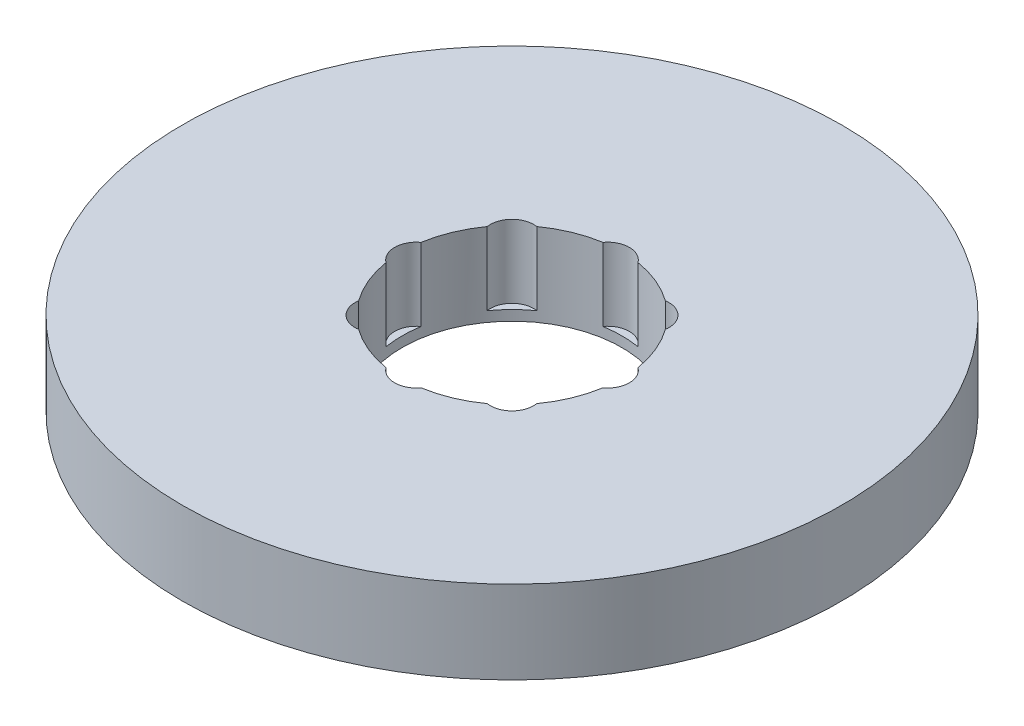
ISO-10303-21;
HEADER;
FILE_DESCRIPTION(('STEP AP214'),'2;1');
FILE_NAME('part.step','',(''),(''),'','','');
FILE_SCHEMA(('AUTOMOTIVE_DESIGN { 1 0 10303 214 1 1 1 1 }'));
ENDSEC;
DATA;
#1=APPLICATION_CONTEXT('core data for automotive mechanical design processes');
#2=APPLICATION_PROTOCOL_DEFINITION('international standard','automotive_design',2000,#1);
#3=PRODUCT_CONTEXT('',#1,'mechanical');
#4=PRODUCT('Part','Part','',(#3));
#5=PRODUCT_RELATED_PRODUCT_CATEGORY('part','',(#4));
#6=PRODUCT_DEFINITION_FORMATION('','',#4);
#7=PRODUCT_DEFINITION_CONTEXT('part definition',#1,'design');
#8=PRODUCT_DEFINITION('design','',#6,#7);
#9=PRODUCT_DEFINITION_SHAPE('','',#8);
#10=(LENGTH_UNIT() NAMED_UNIT(*) SI_UNIT(.MILLI.,.METRE.));
#11=(NAMED_UNIT(*) PLANE_ANGLE_UNIT() SI_UNIT($,.RADIAN.));
#12=(NAMED_UNIT(*) SI_UNIT($,.STERADIAN.) SOLID_ANGLE_UNIT());
#13=UNCERTAINTY_MEASURE_WITH_UNIT(LENGTH_MEASURE(1.E-05),#10,'distance_accuracy_value','');
#14=(GEOMETRIC_REPRESENTATION_CONTEXT(3) GLOBAL_UNCERTAINTY_ASSIGNED_CONTEXT((#13)) GLOBAL_UNIT_ASSIGNED_CONTEXT((#10,
#11,#12)) REPRESENTATION_CONTEXT('',''));
#15=CARTESIAN_POINT('',(0.,0.,0.));
#16=DIRECTION('',(0.,0.,1.));
#17=DIRECTION('',(1.,0.,0.));
#18=AXIS2_PLACEMENT_3D('',#15,#16,#17);
#19=CARTESIAN_POINT('',(0.,17.,0.));
#20=DIRECTION('',(0.,-1.,0.));
#21=DIRECTION('',(0.,0.,-1.));
#22=AXIS2_PLACEMENT_3D('',#19,#20,#21);
#23=CYLINDRICAL_SURFACE('',#22,67.5);
#24=CARTESIAN_POINT('',(0.,17.,0.));
#25=DIRECTION('',(0.,1.,0.));
#26=DIRECTION('',(0.,0.,1.));
#27=AXIS2_PLACEMENT_3D('',#24,#25,#26);
#28=CIRCLE('',#27,67.5);
#29=CARTESIAN_POINT('',(0.,17.,67.5));
#30=VERTEX_POINT('',#29);
#31=EDGE_CURVE('E183',#30,#30,#28,.T.);
#32=ORIENTED_EDGE('',*,*,#31,.F.);
#33=EDGE_LOOP('',(#32));
#34=FACE_BOUND('',#33,.T.);
#35=CARTESIAN_POINT('',(0.,0.,0.));
#36=DIRECTION('',(0.,1.,0.));
#37=DIRECTION('',(0.,0.,1.));
#38=AXIS2_PLACEMENT_3D('',#35,#36,#37);
#39=CIRCLE('',#38,67.5);
#40=CARTESIAN_POINT('',(0.,0.,67.5));
#41=VERTEX_POINT('',#40);
#42=EDGE_CURVE('E182',#41,#41,#39,.T.);
#43=ORIENTED_EDGE('',*,*,#42,.T.);
#44=EDGE_LOOP('',(#43));
#45=FACE_BOUND('',#44,.T.);
#46=ADVANCED_FACE('F39',(#34,#45),#23,.T.);
#47=CARTESIAN_POINT('',(0.,17.,0.));
#48=DIRECTION('',(0.,1.,0.));
#49=DIRECTION('',(0.,0.,1.));
#50=AXIS2_PLACEMENT_3D('',#47,#48,#49);
#51=PLANE('',#50);
#52=CARTESIAN_POINT('',(0.,17.,19.5928557793031));
#53=DIRECTION('',(0.,1.,0.));
#54=DIRECTION('',(1.,0.,0.));
#55=AXIS2_PLACEMENT_3D('',#52,#53,#54);
#56=CIRCLE('',#55,4.44290214076101);
#57=CARTESIAN_POINT('',(-3.58884169918766,17.,22.2119385749685));
#58=VERTEX_POINT('',#57);
#59=CARTESIAN_POINT('',(3.58884169918782,17.,22.2119385749684));
#60=VERTEX_POINT('',#59);
#61=EDGE_CURVE('E256',#58,#60,#56,.T.);
#62=ORIENTED_EDGE('',*,*,#61,.F.);
#63=CARTESIAN_POINT('',(0.,17.,0.));
#64=DIRECTION('',(0.,1.,0.));
#65=DIRECTION('',(0.,0.,1.));
#66=AXIS2_PLACEMENT_3D('',#63,#64,#65);
#67=CIRCLE('',#66,22.5);
#68=CARTESIAN_POINT('',(-13.1685180875585,17.,18.24390669176));
#69=VERTEX_POINT('',#68);
#70=EDGE_CURVE('E175',#69,#58,#67,.T.);
#71=ORIENTED_EDGE('',*,*,#70,.F.);
#72=CARTESIAN_POINT('',(-13.8542411843553,17.,13.8542411843553));
#73=DIRECTION('',(0.,1.,0.));
#74=DIRECTION('',(0.707106781186549,0.,0.707106781186546));
#75=AXIS2_PLACEMENT_3D('',#72,#73,#74);
#76=CIRCLE('',#75,4.44290214076101);
#77=CARTESIAN_POINT('',(-18.2439066917599,17.,13.1685180875586));
#78=VERTEX_POINT('',#77);
#79=EDGE_CURVE('E152',#78,#69,#76,.T.);
#80=ORIENTED_EDGE('',*,*,#79,.F.);
#81=CARTESIAN_POINT('',(-22.2119385749684,17.,3.58884169918774));
#82=VERTEX_POINT('',#81);
#83=EDGE_CURVE('E168',#82,#78,#67,.T.);
#84=ORIENTED_EDGE('',*,*,#83,.F.);
#85=CARTESIAN_POINT('',(-19.5928557793031,17.,0.));
#86=DIRECTION('',(0.,1.,0.));
#87=DIRECTION('',(0.,0.,1.));
#88=AXIS2_PLACEMENT_3D('',#85,#86,#87);
#89=CIRCLE('',#88,4.44290214076101);
#90=CARTESIAN_POINT('',(-22.2119385749684,17.,-3.58884169918774));
#91=VERTEX_POINT('',#90);
#92=EDGE_CURVE('E205',#91,#82,#89,.T.);
#93=ORIENTED_EDGE('',*,*,#92,.F.);
#94=CARTESIAN_POINT('',(-18.2439066917601,17.,-13.1685180875583));
#95=VERTEX_POINT('',#94);
#96=EDGE_CURVE('E181',#95,#91,#67,.T.);
#97=ORIENTED_EDGE('',*,*,#96,.F.);
#98=CARTESIAN_POINT('',(-13.8542411843555,17.,-13.8542411843551));
#99=DIRECTION('',(0.,1.,0.));
#100=DIRECTION('',(-0.707106781186539,0.,0.707106781186556));
#101=AXIS2_PLACEMENT_3D('',#98,#99,#100);
#102=CIRCLE('',#101,4.44290214076101);
#103=CARTESIAN_POINT('',(-13.1685180875588,17.,-18.2439066917598));
#104=VERTEX_POINT('',#103);
#105=EDGE_CURVE('E453',#104,#95,#102,.T.);
#106=ORIENTED_EDGE('',*,*,#105,.F.);
#107=CARTESIAN_POINT('',(-3.58884169918797,17.,-22.2119385749684));
#108=VERTEX_POINT('',#107);
#109=EDGE_CURVE('E189',#108,#104,#67,.T.);
#110=ORIENTED_EDGE('',*,*,#109,.F.);
#111=CARTESIAN_POINT('',(-2.05224270984245E-13,17.,-19.5928557793031));
#112=DIRECTION('',(0.,1.,0.));
#113=DIRECTION('',(-1.,0.,0.));
#114=AXIS2_PLACEMENT_3D('',#111,#112,#113);
#115=CIRCLE('',#114,4.44290214076101);
#116=CARTESIAN_POINT('',(3.5888416991875,17.,-22.2119385749685));
#117=VERTEX_POINT('',#116);
#118=EDGE_CURVE('E462',#117,#108,#115,.T.);
#119=ORIENTED_EDGE('',*,*,#118,.F.);
#120=CARTESIAN_POINT('',(13.1685180875584,17.,-18.2439066917601));
#121=VERTEX_POINT('',#120);
#122=EDGE_CURVE('E197',#121,#117,#67,.T.);
#123=ORIENTED_EDGE('',*,*,#122,.F.);
#124=CARTESIAN_POINT('',(13.8542411843552,17.,-13.8542411843554));
#125=DIRECTION('',(0.,1.,0.));
#126=DIRECTION('',(-0.707106781186554,0.,-0.707106781186541));
#127=AXIS2_PLACEMENT_3D('',#124,#125,#126);
#128=CIRCLE('',#127,4.44290214076101);
#129=CARTESIAN_POINT('',(18.2439066917598,17.,-13.1685180875587));
#130=VERTEX_POINT('',#129);
#131=EDGE_CURVE('E470',#130,#121,#128,.T.);
#132=ORIENTED_EDGE('',*,*,#131,.F.);
#133=CARTESIAN_POINT('',(22.2119385749684,17.,-3.58884169918774));
#134=VERTEX_POINT('',#133);
#135=EDGE_CURVE('E489',#134,#130,#67,.T.);
#136=ORIENTED_EDGE('',*,*,#135,.F.);
#137=CARTESIAN_POINT('',(19.5928557793031,17.,0.));
#138=DIRECTION('',(0.,1.,0.));
#139=DIRECTION('',(0.,0.,-1.));
#140=AXIS2_PLACEMENT_3D('',#137,#138,#139);
#141=CIRCLE('',#140,4.44290214076101);
#142=CARTESIAN_POINT('',(22.2119385749684,17.,3.58884169918774));
#143=VERTEX_POINT('',#142);
#144=EDGE_CURVE('E476',#143,#134,#141,.T.);
#145=ORIENTED_EDGE('',*,*,#144,.F.);
#146=CARTESIAN_POINT('',(18.24390669176,17.,13.1685180875585));
#147=VERTEX_POINT('',#146);
#148=EDGE_CURVE('E491',#147,#143,#67,.T.);
#149=ORIENTED_EDGE('',*,*,#148,.F.);
#150=CARTESIAN_POINT('',(13.8542411843554,17.,13.8542411843552));
#151=DIRECTION('',(0.,1.,0.));
#152=DIRECTION('',(0.707106781186544,0.,-0.707106781186551));
#153=AXIS2_PLACEMENT_3D('',#150,#151,#152);
#154=CIRCLE('',#153,4.44290214076101);
#155=CARTESIAN_POINT('',(13.1685180875586,17.,18.2439066917599));
#156=VERTEX_POINT('',#155);
#157=EDGE_CURVE('E475',#156,#147,#154,.T.);
#158=ORIENTED_EDGE('',*,*,#157,.F.);
#159=EDGE_CURVE('E190',#60,#156,#67,.T.);
#160=ORIENTED_EDGE('',*,*,#159,.F.);
#161=EDGE_LOOP('',(#62,#71,#80,#84,#93,#97,#106,#110,#119,#123,#132,#136,#145,#149,#158,#160));
#162=FACE_BOUND('',#161,.T.);
#163=ORIENTED_EDGE('',*,*,#31,.T.);
#164=EDGE_LOOP('',(#163));
#165=FACE_BOUND('',#164,.T.);
#166=ADVANCED_FACE('F170',(#162,#165),#51,.T.);
#167=CARTESIAN_POINT('',(0.,0.,0.));
#168=DIRECTION('',(0.,1.,0.));
#169=DIRECTION('',(0.,0.,1.));
#170=AXIS2_PLACEMENT_3D('',#167,#168,#169);
#171=PLANE('',#170);
#172=CARTESIAN_POINT('',(0.,0.,0.));
#173=DIRECTION('',(0.,1.,0.));
#174=DIRECTION('',(0.,0.,1.));
#175=AXIS2_PLACEMENT_3D('',#172,#173,#174);
#176=CIRCLE('',#175,22.5);
#177=CARTESIAN_POINT('',(0.,0.,22.5));
#178=VERTEX_POINT('',#177);
#179=EDGE_CURVE('E191',#178,#178,#176,.T.);
#180=ORIENTED_EDGE('',*,*,#179,.T.);
#181=EDGE_LOOP('',(#180));
#182=FACE_BOUND('',#181,.T.);
#183=ORIENTED_EDGE('',*,*,#42,.F.);
#184=EDGE_LOOP('',(#183));
#185=FACE_BOUND('',#184,.T.);
#186=ADVANCED_FACE('F277',(#182,#185),#171,.F.);
#187=CARTESIAN_POINT('',(0.,17.,0.));
#188=DIRECTION('',(0.,-1.,0.));
#189=DIRECTION('',(0.,0.,-1.));
#190=AXIS2_PLACEMENT_3D('',#187,#188,#189);
#191=CYLINDRICAL_SURFACE('',#190,22.5);
#192=DIRECTION('',(0.,1.,0.));
#193=VECTOR('',#192,1.);
#194=CARTESIAN_POINT('',(-3.58884169918766,9.54235982658653,22.2119385749685));
#195=LINE('',#194,#193);
#196=CARTESIAN_POINT('',(-3.58884169918766,2.08471965317305,22.2119385749685));
#197=VERTEX_POINT('',#196);
#198=EDGE_CURVE('E11',#197,#58,#195,.T.);
#199=ORIENTED_EDGE('',*,*,#198,.F.);
#200=CARTESIAN_POINT('',(0.,2.08471965317305,0.));
#201=DIRECTION('',(0.,1.,0.));
#202=DIRECTION('',(0.,0.,1.));
#203=AXIS2_PLACEMENT_3D('',#200,#201,#202);
#204=CIRCLE('',#203,22.5);
#205=CARTESIAN_POINT('',(3.58884169918782,2.08471965317305,22.2119385749684));
#206=VERTEX_POINT('',#205);
#207=EDGE_CURVE('E251',#197,#206,#204,.T.);
#208=ORIENTED_EDGE('',*,*,#207,.T.);
#209=DIRECTION('',(0.,1.,0.));
#210=VECTOR('',#209,1.);
#211=CARTESIAN_POINT('',(3.58884169918782,9.54235982658653,22.2119385749684));
#212=LINE('',#211,#210);
#213=EDGE_CURVE('E46',#60,#206,#212,.F.);
#214=ORIENTED_EDGE('',*,*,#213,.F.);
#215=ORIENTED_EDGE('',*,*,#159,.T.);
#216=DIRECTION('',(0.,1.,0.));
#217=VECTOR('',#216,1.);
#218=CARTESIAN_POINT('',(13.1685180875586,9.54235982658653,18.2439066917599));
#219=LINE('',#218,#217);
#220=CARTESIAN_POINT('',(13.1685180875586,2.08471965317305,18.2439066917599));
#221=VERTEX_POINT('',#220);
#222=EDGE_CURVE('E253',#221,#156,#219,.T.);
#223=ORIENTED_EDGE('',*,*,#222,.F.);
#224=CARTESIAN_POINT('',(0.,2.08471965317305,0.));
#225=DIRECTION('',(0.,1.,0.));
#226=DIRECTION('',(0.,0.,1.));
#227=AXIS2_PLACEMENT_3D('',#224,#225,#226);
#228=CIRCLE('',#227,22.5);
#229=CARTESIAN_POINT('',(18.24390669176,2.08471965317305,13.1685180875585));
#230=VERTEX_POINT('',#229);
#231=EDGE_CURVE('E246',#221,#230,#228,.T.);
#232=ORIENTED_EDGE('',*,*,#231,.T.);
#233=DIRECTION('',(0.,1.,0.));
#234=VECTOR('',#233,1.);
#235=CARTESIAN_POINT('',(18.24390669176,9.54235982658653,13.1685180875585));
#236=LINE('',#235,#234);
#237=EDGE_CURVE('E248',#147,#230,#236,.F.);
#238=ORIENTED_EDGE('',*,*,#237,.F.);
#239=ORIENTED_EDGE('',*,*,#148,.T.);
#240=DIRECTION('',(0.,1.,0.));
#241=VECTOR('',#240,1.);
#242=CARTESIAN_POINT('',(22.2119385749684,9.54235982658653,3.58884169918774));
#243=LINE('',#242,#241);
#244=CARTESIAN_POINT('',(22.2119385749684,2.08471965317305,3.58884169918774));
#245=VERTEX_POINT('',#244);
#246=EDGE_CURVE('E243',#245,#143,#243,.T.);
#247=ORIENTED_EDGE('',*,*,#246,.F.);
#248=CARTESIAN_POINT('',(0.,2.08471965317305,0.));
#249=DIRECTION('',(0.,1.,0.));
#250=DIRECTION('',(0.,0.,1.));
#251=AXIS2_PLACEMENT_3D('',#248,#249,#250);
#252=CIRCLE('',#251,22.5);
#253=CARTESIAN_POINT('',(22.2119385749684,2.08471965317305,-3.58884169918774));
#254=VERTEX_POINT('',#253);
#255=EDGE_CURVE('E236',#245,#254,#252,.T.);
#256=ORIENTED_EDGE('',*,*,#255,.T.);
#257=DIRECTION('',(0.,1.,0.));
#258=VECTOR('',#257,1.);
#259=CARTESIAN_POINT('',(22.2119385749684,9.54235982658653,-3.58884169918774));
#260=LINE('',#259,#258);
#261=EDGE_CURVE('E241',#134,#254,#260,.F.);
#262=ORIENTED_EDGE('',*,*,#261,.F.);
#263=ORIENTED_EDGE('',*,*,#135,.T.);
#264=DIRECTION('',(0.,1.,0.));
#265=VECTOR('',#264,1.);
#266=CARTESIAN_POINT('',(18.2439066917598,9.54235982658653,-13.1685180875587));
#267=LINE('',#266,#265);
#268=CARTESIAN_POINT('',(18.2439066917598,2.08471965317305,-13.1685180875587));
#269=VERTEX_POINT('',#268);
#270=EDGE_CURVE('E237',#269,#130,#267,.T.);
#271=ORIENTED_EDGE('',*,*,#270,.F.);
#272=CARTESIAN_POINT('',(0.,2.08471965317305,0.));
#273=DIRECTION('',(0.,1.,0.));
#274=DIRECTION('',(0.,0.,1.));
#275=AXIS2_PLACEMENT_3D('',#272,#273,#274);
#276=CIRCLE('',#275,22.5);
#277=CARTESIAN_POINT('',(13.1685180875584,2.08471965317305,-18.2439066917601));
#278=VERTEX_POINT('',#277);
#279=EDGE_CURVE('E229',#269,#278,#276,.T.);
#280=ORIENTED_EDGE('',*,*,#279,.T.);
#281=DIRECTION('',(0.,1.,0.));
#282=VECTOR('',#281,1.);
#283=CARTESIAN_POINT('',(13.1685180875584,9.54235982658653,-18.2439066917601));
#284=LINE('',#283,#282);
#285=EDGE_CURVE('E232',#121,#278,#284,.F.);
#286=ORIENTED_EDGE('',*,*,#285,.F.);
#287=ORIENTED_EDGE('',*,*,#122,.T.);
#288=DIRECTION('',(0.,1.,0.));
#289=VECTOR('',#288,1.);
#290=CARTESIAN_POINT('',(3.58884169918751,9.54235982658653,-22.2119385749685));
#291=LINE('',#290,#289);
#292=CARTESIAN_POINT('',(3.5888416991875,2.08471965317305,-22.2119385749685));
#293=VERTEX_POINT('',#292);
#294=EDGE_CURVE('E227',#293,#117,#291,.T.);
#295=ORIENTED_EDGE('',*,*,#294,.F.);
#296=CARTESIAN_POINT('',(0.,2.08471965317305,0.));
#297=DIRECTION('',(0.,1.,0.));
#298=DIRECTION('',(0.,0.,1.));
#299=AXIS2_PLACEMENT_3D('',#296,#297,#298);
#300=CIRCLE('',#299,22.5);
#301=CARTESIAN_POINT('',(-3.58884169918797,2.08471965317305,-22.2119385749684));
#302=VERTEX_POINT('',#301);
#303=EDGE_CURVE('E225',#293,#302,#300,.T.);
#304=ORIENTED_EDGE('',*,*,#303,.T.);
#305=DIRECTION('',(0.,1.,0.));
#306=VECTOR('',#305,1.);
#307=CARTESIAN_POINT('',(-3.58884169918797,9.54235982658653,-22.2119385749684));
#308=LINE('',#307,#306);
#309=EDGE_CURVE('E223',#108,#302,#308,.F.);
#310=ORIENTED_EDGE('',*,*,#309,.F.);
#311=ORIENTED_EDGE('',*,*,#109,.T.);
#312=DIRECTION('',(0.,1.,0.));
#313=VECTOR('',#312,1.);
#314=CARTESIAN_POINT('',(-13.1685180875588,9.54235982658653,-18.2439066917598));
#315=LINE('',#314,#313);
#316=CARTESIAN_POINT('',(-13.1685180875588,2.08471965317305,-18.2439066917598));
#317=VERTEX_POINT('',#316);
#318=EDGE_CURVE('E219',#317,#104,#315,.T.);
#319=ORIENTED_EDGE('',*,*,#318,.F.);
#320=CARTESIAN_POINT('',(0.,2.08471965317305,0.));
#321=DIRECTION('',(0.,1.,0.));
#322=DIRECTION('',(0.,0.,1.));
#323=AXIS2_PLACEMENT_3D('',#320,#321,#322);
#324=CIRCLE('',#323,22.5);
#325=CARTESIAN_POINT('',(-18.2439066917601,2.08471965317305,-13.1685180875583));
#326=VERTEX_POINT('',#325);
#327=EDGE_CURVE('E159',#317,#326,#324,.T.);
#328=ORIENTED_EDGE('',*,*,#327,.T.);
#329=DIRECTION('',(0.,1.,0.));
#330=VECTOR('',#329,1.);
#331=CARTESIAN_POINT('',(-18.2439066917601,9.54235982658653,-13.1685180875583));
#332=LINE('',#331,#330);
#333=EDGE_CURVE('E220',#95,#326,#332,.F.);
#334=ORIENTED_EDGE('',*,*,#333,.F.);
#335=ORIENTED_EDGE('',*,*,#96,.T.);
#336=DIRECTION('',(0.,1.,0.));
#337=VECTOR('',#336,1.);
#338=CARTESIAN_POINT('',(-22.2119385749684,9.54235982658653,-3.58884169918774));
#339=LINE('',#338,#337);
#340=CARTESIAN_POINT('',(-22.2119385749684,2.08471965317305,-3.58884169918774));
#341=VERTEX_POINT('',#340);
#342=EDGE_CURVE('E209',#341,#91,#339,.T.);
#343=ORIENTED_EDGE('',*,*,#342,.F.);
#344=CARTESIAN_POINT('',(0.,2.08471965317305,0.));
#345=DIRECTION('',(0.,1.,0.));
#346=DIRECTION('',(0.,0.,1.));
#347=AXIS2_PLACEMENT_3D('',#344,#345,#346);
#348=CIRCLE('',#347,22.5);
#349=CARTESIAN_POINT('',(-22.2119385749684,2.08471965317305,3.58884169918774));
#350=VERTEX_POINT('',#349);
#351=EDGE_CURVE('E206',#341,#350,#348,.T.);
#352=ORIENTED_EDGE('',*,*,#351,.T.);
#353=DIRECTION('',(0.,1.,0.));
#354=VECTOR('',#353,1.);
#355=CARTESIAN_POINT('',(-22.2119385749684,9.54235982658653,3.58884169918774));
#356=LINE('',#355,#354);
#357=EDGE_CURVE('E179',#82,#350,#356,.F.);
#358=ORIENTED_EDGE('',*,*,#357,.F.);
#359=ORIENTED_EDGE('',*,*,#83,.T.);
#360=DIRECTION('',(0.,1.,0.));
#361=VECTOR('',#360,1.);
#362=CARTESIAN_POINT('',(-18.2439066917599,9.54235982658653,13.1685180875586));
#363=LINE('',#362,#361);
#364=CARTESIAN_POINT('',(-18.2439066917599,2.08471965317305,13.1685180875586));
#365=VERTEX_POINT('',#364);
#366=EDGE_CURVE('E147',#365,#78,#363,.T.);
#367=ORIENTED_EDGE('',*,*,#366,.F.);
#368=CARTESIAN_POINT('',(0.,2.08471965317305,0.));
#369=DIRECTION('',(0.,1.,0.));
#370=DIRECTION('',(0.,0.,1.));
#371=AXIS2_PLACEMENT_3D('',#368,#369,#370);
#372=CIRCLE('',#371,22.5);
#373=CARTESIAN_POINT('',(-13.1685180875585,2.08471965317305,18.24390669176));
#374=VERTEX_POINT('',#373);
#375=EDGE_CURVE('E215',#365,#374,#372,.T.);
#376=ORIENTED_EDGE('',*,*,#375,.T.);
#377=DIRECTION('',(0.,1.,0.));
#378=VECTOR('',#377,1.);
#379=CARTESIAN_POINT('',(-13.1685180875585,9.54235982658653,18.24390669176));
#380=LINE('',#379,#378);
#381=EDGE_CURVE('E161',#69,#374,#380,.F.);
#382=ORIENTED_EDGE('',*,*,#381,.F.);
#383=ORIENTED_EDGE('',*,*,#70,.T.);
#384=EDGE_LOOP('',(#199,#208,#214,#215,#223,#232,#238,#239,#247,#256,#262,#263,#271,#280,#286,
#287,#295,#304,#310,#311,#319,#328,#334,#335,#343,#352,#358,#359,#367,#376,#382,#383));
#385=FACE_BOUND('',#384,.T.);
#386=ORIENTED_EDGE('',*,*,#179,.F.);
#387=EDGE_LOOP('',(#386));
#388=FACE_BOUND('',#387,.T.);
#389=ADVANCED_FACE('F176',(#385,#388),#191,.F.);
#390=CARTESIAN_POINT('',(-19.5928557793031,2.08471965317305,0.));
#391=DIRECTION('',(0.,1.,0.));
#392=DIRECTION('',(0.,0.,1.));
#393=AXIS2_PLACEMENT_3D('',#390,#391,#392);
#394=CYLINDRICAL_SURFACE('',#393,4.44290214076101);
#395=ORIENTED_EDGE('',*,*,#342,.T.);
#396=ORIENTED_EDGE('',*,*,#92,.T.);
#397=ORIENTED_EDGE('',*,*,#357,.T.);
#398=CARTESIAN_POINT('',(-19.5928557793031,2.08471965317305,0.));
#399=DIRECTION('',(0.,1.,0.));
#400=DIRECTION('',(0.,0.,1.));
#401=AXIS2_PLACEMENT_3D('',#398,#399,#400);
#402=CIRCLE('',#401,4.44290214076101);
#403=EDGE_CURVE('E200',#341,#350,#402,.T.);
#404=ORIENTED_EDGE('',*,*,#403,.F.);
#405=EDGE_LOOP('',(#395,#396,#397,#404));
#406=FACE_BOUND('',#405,.T.);
#407=ADVANCED_FACE('F286',(#406),#394,.F.);
#408=CARTESIAN_POINT('',(-19.5928557793031,2.08471965317305,0.));
#409=DIRECTION('',(0.,1.,0.));
#410=DIRECTION('',(0.,0.,1.));
#411=AXIS2_PLACEMENT_3D('',#408,#409,#410);
#412=PLANE('',#411);
#413=ORIENTED_EDGE('',*,*,#403,.T.);
#414=ORIENTED_EDGE('',*,*,#351,.F.);
#415=EDGE_LOOP('',(#413,#414));
#416=FACE_BOUND('',#415,.T.);
#417=ADVANCED_FACE('F289',(#416),#412,.T.);
#418=CARTESIAN_POINT('',(-13.8542411843553,2.08471965317305,13.8542411843553));
#419=DIRECTION('',(0.,1.,0.));
#420=DIRECTION('',(0.,0.,1.));
#421=AXIS2_PLACEMENT_3D('',#418,#419,#420);
#422=CYLINDRICAL_SURFACE('',#421,4.44290214076101);
#423=ORIENTED_EDGE('',*,*,#366,.T.);
#424=ORIENTED_EDGE('',*,*,#79,.T.);
#425=ORIENTED_EDGE('',*,*,#381,.T.);
#426=CARTESIAN_POINT('',(-13.8542411843553,2.08471965317305,13.8542411843553));
#427=DIRECTION('',(0.,1.,0.));
#428=DIRECTION('',(0.707106781186549,0.,0.707106781186546));
#429=AXIS2_PLACEMENT_3D('',#426,#427,#428);
#430=CIRCLE('',#429,4.44290214076101);
#431=EDGE_CURVE('E156',#365,#374,#430,.T.);
#432=ORIENTED_EDGE('',*,*,#431,.F.);
#433=EDGE_LOOP('',(#423,#424,#425,#432));
#434=FACE_BOUND('',#433,.T.);
#435=ADVANCED_FACE('F155',(#434),#422,.F.);
#436=CARTESIAN_POINT('',(-13.8542411843553,2.08471965317305,13.8542411843553));
#437=DIRECTION('',(0.,1.,0.));
#438=DIRECTION('',(0.707106781186549,0.,0.707106781186546));
#439=AXIS2_PLACEMENT_3D('',#436,#437,#438);
#440=PLANE('',#439);
#441=ORIENTED_EDGE('',*,*,#431,.T.);
#442=ORIENTED_EDGE('',*,*,#375,.F.);
#443=EDGE_LOOP('',(#441,#442));
#444=FACE_BOUND('',#443,.T.);
#445=ADVANCED_FACE('F300',(#444),#440,.T.);
#446=CARTESIAN_POINT('',(-13.8542411843555,2.08471965317305,-13.8542411843551));
#447=DIRECTION('',(0.,1.,0.));
#448=DIRECTION('',(0.,0.,1.));
#449=AXIS2_PLACEMENT_3D('',#446,#447,#448);
#450=CYLINDRICAL_SURFACE('',#449,4.44290214076101);
#451=ORIENTED_EDGE('',*,*,#318,.T.);
#452=ORIENTED_EDGE('',*,*,#105,.T.);
#453=ORIENTED_EDGE('',*,*,#333,.T.);
#454=CARTESIAN_POINT('',(-13.8542411843555,2.08471965317305,-13.8542411843551));
#455=DIRECTION('',(0.,1.,0.));
#456=DIRECTION('',(-0.707106781186539,0.,0.707106781186556));
#457=AXIS2_PLACEMENT_3D('',#454,#455,#456);
#458=CIRCLE('',#457,4.44290214076101);
#459=EDGE_CURVE('E454',#317,#326,#458,.T.);
#460=ORIENTED_EDGE('',*,*,#459,.F.);
#461=EDGE_LOOP('',(#451,#452,#453,#460));
#462=FACE_BOUND('',#461,.T.);
#463=ADVANCED_FACE('F299',(#462),#450,.F.);
#464=CARTESIAN_POINT('',(-13.8542411843555,2.08471965317305,-13.8542411843551));
#465=DIRECTION('',(0.,1.,0.));
#466=DIRECTION('',(-0.707106781186539,0.,0.707106781186556));
#467=AXIS2_PLACEMENT_3D('',#464,#465,#466);
#468=PLANE('',#467);
#469=ORIENTED_EDGE('',*,*,#459,.T.);
#470=ORIENTED_EDGE('',*,*,#327,.F.);
#471=EDGE_LOOP('',(#469,#470));
#472=FACE_BOUND('',#471,.T.);
#473=ADVANCED_FACE('F379',(#472),#468,.T.);
#474=CARTESIAN_POINT('',(-2.05224270984245E-13,2.08471965317305,-19.5928557793031));
#475=DIRECTION('',(0.,1.,0.));
#476=DIRECTION('',(0.,0.,1.));
#477=AXIS2_PLACEMENT_3D('',#474,#475,#476);
#478=CYLINDRICAL_SURFACE('',#477,4.44290214076101);
#479=ORIENTED_EDGE('',*,*,#294,.T.);
#480=ORIENTED_EDGE('',*,*,#118,.T.);
#481=ORIENTED_EDGE('',*,*,#309,.T.);
#482=CARTESIAN_POINT('',(-2.05224270984245E-13,2.08471965317305,-19.5928557793031));
#483=DIRECTION('',(0.,1.,0.));
#484=DIRECTION('',(-1.,0.,0.));
#485=AXIS2_PLACEMENT_3D('',#482,#483,#484);
#486=CIRCLE('',#485,4.44290214076101);
#487=EDGE_CURVE('E465',#293,#302,#486,.T.);
#488=ORIENTED_EDGE('',*,*,#487,.F.);
#489=EDGE_LOOP('',(#479,#480,#481,#488));
#490=FACE_BOUND('',#489,.T.);
#491=ADVANCED_FACE('F371',(#490),#478,.F.);
#492=CARTESIAN_POINT('',(-2.05224270984245E-13,2.08471965317305,-19.5928557793031));
#493=DIRECTION('',(0.,1.,0.));
#494=DIRECTION('',(-1.,0.,0.));
#495=AXIS2_PLACEMENT_3D('',#492,#493,#494);
#496=PLANE('',#495);
#497=ORIENTED_EDGE('',*,*,#487,.T.);
#498=ORIENTED_EDGE('',*,*,#303,.F.);
#499=EDGE_LOOP('',(#497,#498));
#500=FACE_BOUND('',#499,.T.);
#501=ADVANCED_FACE('F308',(#500),#496,.T.);
#502=CARTESIAN_POINT('',(13.8542411843552,2.08471965317305,-13.8542411843554));
#503=DIRECTION('',(0.,1.,0.));
#504=DIRECTION('',(0.,0.,1.));
#505=AXIS2_PLACEMENT_3D('',#502,#503,#504);
#506=CYLINDRICAL_SURFACE('',#505,4.44290214076101);
#507=ORIENTED_EDGE('',*,*,#270,.T.);
#508=ORIENTED_EDGE('',*,*,#131,.T.);
#509=ORIENTED_EDGE('',*,*,#285,.T.);
#510=CARTESIAN_POINT('',(13.8542411843552,2.08471965317305,-13.8542411843554));
#511=DIRECTION('',(0.,1.,0.));
#512=DIRECTION('',(-0.707106781186554,0.,-0.707106781186541));
#513=AXIS2_PLACEMENT_3D('',#510,#511,#512);
#514=CIRCLE('',#513,4.44290214076101);
#515=EDGE_CURVE('E477',#269,#278,#514,.T.);
#516=ORIENTED_EDGE('',*,*,#515,.F.);
#517=EDGE_LOOP('',(#507,#508,#509,#516));
#518=FACE_BOUND('',#517,.T.);
#519=ADVANCED_FACE('F305',(#518),#506,.F.);
#520=CARTESIAN_POINT('',(13.8542411843552,2.08471965317305,-13.8542411843554));
#521=DIRECTION('',(0.,1.,0.));
#522=DIRECTION('',(-0.707106781186554,0.,-0.707106781186541));
#523=AXIS2_PLACEMENT_3D('',#520,#521,#522);
#524=PLANE('',#523);
#525=ORIENTED_EDGE('',*,*,#515,.T.);
#526=ORIENTED_EDGE('',*,*,#279,.F.);
#527=EDGE_LOOP('',(#525,#526));
#528=FACE_BOUND('',#527,.T.);
#529=ADVANCED_FACE('F304',(#528),#524,.T.);
#530=CARTESIAN_POINT('',(19.5928557793031,2.08471965317305,0.));
#531=DIRECTION('',(0.,1.,0.));
#532=DIRECTION('',(0.,0.,1.));
#533=AXIS2_PLACEMENT_3D('',#530,#531,#532);
#534=CYLINDRICAL_SURFACE('',#533,4.44290214076101);
#535=ORIENTED_EDGE('',*,*,#246,.T.);
#536=ORIENTED_EDGE('',*,*,#144,.T.);
#537=ORIENTED_EDGE('',*,*,#261,.T.);
#538=CARTESIAN_POINT('',(19.5928557793031,2.08471965317305,0.));
#539=DIRECTION('',(0.,1.,0.));
#540=DIRECTION('',(0.,0.,-1.));
#541=AXIS2_PLACEMENT_3D('',#538,#539,#540);
#542=CIRCLE('',#541,4.44290214076101);
#543=EDGE_CURVE('E478',#245,#254,#542,.T.);
#544=ORIENTED_EDGE('',*,*,#543,.F.);
#545=EDGE_LOOP('',(#535,#536,#537,#544));
#546=FACE_BOUND('',#545,.T.);
#547=ADVANCED_FACE('F309',(#546),#534,.F.);
#548=CARTESIAN_POINT('',(19.5928557793031,2.08471965317305,0.));
#549=DIRECTION('',(0.,1.,0.));
#550=DIRECTION('',(0.,0.,-1.));
#551=AXIS2_PLACEMENT_3D('',#548,#549,#550);
#552=PLANE('',#551);
#553=ORIENTED_EDGE('',*,*,#543,.T.);
#554=ORIENTED_EDGE('',*,*,#255,.F.);
#555=EDGE_LOOP('',(#553,#554));
#556=FACE_BOUND('',#555,.T.);
#557=ADVANCED_FACE('F314',(#556),#552,.T.);
#558=CARTESIAN_POINT('',(13.8542411843554,2.08471965317305,13.8542411843552));
#559=DIRECTION('',(0.,1.,0.));
#560=DIRECTION('',(0.,0.,1.));
#561=AXIS2_PLACEMENT_3D('',#558,#559,#560);
#562=CYLINDRICAL_SURFACE('',#561,4.44290214076101);
#563=ORIENTED_EDGE('',*,*,#222,.T.);
#564=ORIENTED_EDGE('',*,*,#157,.T.);
#565=ORIENTED_EDGE('',*,*,#237,.T.);
#566=CARTESIAN_POINT('',(13.8542411843554,2.08471965317305,13.8542411843552));
#567=DIRECTION('',(0.,1.,0.));
#568=DIRECTION('',(0.707106781186544,0.,-0.707106781186551));
#569=AXIS2_PLACEMENT_3D('',#566,#567,#568);
#570=CIRCLE('',#569,4.44290214076101);
#571=EDGE_CURVE('E56',#221,#230,#570,.T.);
#572=ORIENTED_EDGE('',*,*,#571,.F.);
#573=EDGE_LOOP('',(#563,#564,#565,#572));
#574=FACE_BOUND('',#573,.T.);
#575=ADVANCED_FACE('F318',(#574),#562,.F.);
#576=CARTESIAN_POINT('',(13.8542411843554,2.08471965317305,13.8542411843552));
#577=DIRECTION('',(0.,1.,0.));
#578=DIRECTION('',(0.707106781186544,0.,-0.707106781186551));
#579=AXIS2_PLACEMENT_3D('',#576,#577,#578);
#580=PLANE('',#579);
#581=ORIENTED_EDGE('',*,*,#571,.T.);
#582=ORIENTED_EDGE('',*,*,#231,.F.);
#583=EDGE_LOOP('',(#581,#582));
#584=FACE_BOUND('',#583,.T.);
#585=ADVANCED_FACE('F270',(#584),#580,.T.);
#586=CARTESIAN_POINT('',(0.,2.08471965317305,19.5928557793031));
#587=DIRECTION('',(0.,1.,0.));
#588=DIRECTION('',(0.,0.,1.));
#589=AXIS2_PLACEMENT_3D('',#586,#587,#588);
#590=CYLINDRICAL_SURFACE('',#589,4.44290214076101);
#591=ORIENTED_EDGE('',*,*,#198,.T.);
#592=ORIENTED_EDGE('',*,*,#61,.T.);
#593=ORIENTED_EDGE('',*,*,#213,.T.);
#594=CARTESIAN_POINT('',(0.,2.08471965317305,19.5928557793031));
#595=DIRECTION('',(0.,1.,0.));
#596=DIRECTION('',(1.,0.,0.));
#597=AXIS2_PLACEMENT_3D('',#594,#595,#596);
#598=CIRCLE('',#597,4.44290214076101);
#599=EDGE_CURVE('E55',#197,#206,#598,.T.);
#600=ORIENTED_EDGE('',*,*,#599,.F.);
#601=EDGE_LOOP('',(#591,#592,#593,#600));
#602=FACE_BOUND('',#601,.T.);
#603=ADVANCED_FACE('F260',(#602),#590,.F.);
#604=CARTESIAN_POINT('',(0.,2.08471965317305,19.5928557793031));
#605=DIRECTION('',(0.,1.,0.));
#606=DIRECTION('',(1.,0.,0.));
#607=AXIS2_PLACEMENT_3D('',#604,#605,#606);
#608=PLANE('',#607);
#609=ORIENTED_EDGE('',*,*,#599,.T.);
#610=ORIENTED_EDGE('',*,*,#207,.F.);
#611=EDGE_LOOP('',(#609,#610));
#612=FACE_BOUND('',#611,.T.);
#613=ADVANCED_FACE('F261',(#612),#608,.T.);
#614=CLOSED_SHELL('',(#46,#166,#186,#389,#407,#417,#435,#445,#463,#473,#491,#501,#519,#529,#547,
#557,#575,#585,#603,#613));
#615=MANIFOLD_SOLID_BREP('B2',#614);
#616=ADVANCED_BREP_SHAPE_REPRESENTATION('',(#18,#615),#14);
#617=SHAPE_DEFINITION_REPRESENTATION(#9,#616);
ENDSEC;
END-ISO-10303-21;
